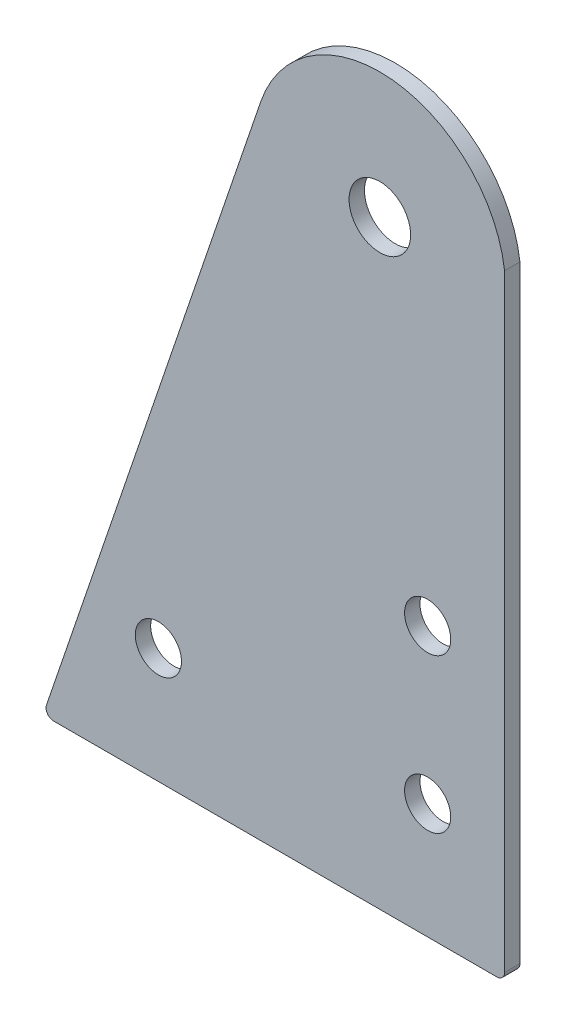
ISO-10303-21;
HEADER;
FILE_DESCRIPTION(('STEP AP214'),'2;1');
FILE_NAME('part.step','',(''),(''),'','','');
FILE_SCHEMA(('AUTOMOTIVE_DESIGN { 1 0 10303 214 1 1 1 1 }'));
ENDSEC;
DATA;
#1=APPLICATION_CONTEXT('core data for automotive mechanical design processes');
#2=APPLICATION_PROTOCOL_DEFINITION('international standard','automotive_design',2000,#1);
#3=PRODUCT_CONTEXT('',#1,'mechanical');
#4=PRODUCT('Part','Part','',(#3));
#5=PRODUCT_RELATED_PRODUCT_CATEGORY('part','',(#4));
#6=PRODUCT_DEFINITION_FORMATION('','',#4);
#7=PRODUCT_DEFINITION_CONTEXT('part definition',#1,'design');
#8=PRODUCT_DEFINITION('design','',#6,#7);
#9=PRODUCT_DEFINITION_SHAPE('','',#8);
#10=(LENGTH_UNIT() NAMED_UNIT(*) SI_UNIT(.MILLI.,.METRE.));
#11=(NAMED_UNIT(*) PLANE_ANGLE_UNIT() SI_UNIT($,.RADIAN.));
#12=(NAMED_UNIT(*) SI_UNIT($,.STERADIAN.) SOLID_ANGLE_UNIT());
#13=UNCERTAINTY_MEASURE_WITH_UNIT(LENGTH_MEASURE(1.E-05),#10,'distance_accuracy_value','');
#14=(GEOMETRIC_REPRESENTATION_CONTEXT(3) GLOBAL_UNCERTAINTY_ASSIGNED_CONTEXT((#13)) GLOBAL_UNIT_ASSIGNED_CONTEXT((#10,
#11,#12)) REPRESENTATION_CONTEXT('',''));
#15=CARTESIAN_POINT('',(0.,0.,0.));
#16=DIRECTION('',(0.,0.,1.));
#17=DIRECTION('',(1.,0.,0.));
#18=AXIS2_PLACEMENT_3D('',#15,#16,#17);
#19=CARTESIAN_POINT('',(0.,0.,-2.));
#20=DIRECTION('',(-1.,0.,0.));
#21=DIRECTION('',(0.,0.,-1.));
#22=AXIS2_PLACEMENT_3D('',#19,#20,#21);
#23=PLANE('',#22);
#24=DIRECTION('',(0.,1.,0.));
#25=VECTOR('',#24,1.);
#26=CARTESIAN_POINT('',(0.,0.,-2.));
#27=LINE('',#26,#25);
#28=CARTESIAN_POINT('',(0.,1.,-2.));
#29=VERTEX_POINT('',#28);
#30=CARTESIAN_POINT('',(0.,79.9999999999999,-2.));
#31=VERTEX_POINT('',#30);
#32=EDGE_CURVE('E85',#29,#31,#27,.T.);
#33=ORIENTED_EDGE('',*,*,#32,.T.);
#34=DIRECTION('',(0.,0.,1.));
#35=VECTOR('',#34,1.);
#36=CARTESIAN_POINT('',(0.,79.9999999999999,-2.));
#37=LINE('',#36,#35);
#38=CARTESIAN_POINT('',(0.,79.9999999999999,0.));
#39=VERTEX_POINT('',#38);
#40=EDGE_CURVE('E93',#31,#39,#37,.T.);
#41=ORIENTED_EDGE('',*,*,#40,.T.);
#42=DIRECTION('',(0.,1.,0.));
#43=VECTOR('',#42,1.);
#44=CARTESIAN_POINT('',(0.,0.,0.));
#45=LINE('',#44,#43);
#46=CARTESIAN_POINT('',(0.,1.,0.));
#47=VERTEX_POINT('',#46);
#48=EDGE_CURVE('E118',#47,#39,#45,.T.);
#49=ORIENTED_EDGE('',*,*,#48,.F.);
#50=DIRECTION('',(0.,0.,1.));
#51=VECTOR('',#50,1.);
#52=CARTESIAN_POINT('',(0.,1.,-2.));
#53=LINE('',#52,#51);
#54=EDGE_CURVE('E100',#29,#47,#53,.T.);
#55=ORIENTED_EDGE('',*,*,#54,.F.);
#56=EDGE_LOOP('',(#33,#41,#49,#55));
#57=FACE_BOUND('',#56,.T.);
#58=ADVANCED_FACE('F33',(#57),#23,.F.);
#59=CARTESIAN_POINT('',(-16.2149706208328,77.9312961356805,-2.));
#60=DIRECTION('',(0.,0.,1.));
#61=DIRECTION('',(-1.,0.,0.));
#62=AXIS2_PLACEMENT_3D('',#59,#60,#61);
#63=CYLINDRICAL_SURFACE('',#62,16.3464004573705);
#64=CARTESIAN_POINT('',(-16.2149706208328,77.9312961356805,0.));
#65=DIRECTION('',(0.,0.,1.));
#66=DIRECTION('',(1.,0.,0.));
#67=AXIS2_PLACEMENT_3D('',#64,#65,#66);
#68=CIRCLE('',#67,16.3464004573705);
#69=CARTESIAN_POINT('',(-31.6899927739786,83.1970816679981,0.));
#70=VERTEX_POINT('',#69);
#71=EDGE_CURVE('E96',#39,#70,#68,.T.);
#72=ORIENTED_EDGE('',*,*,#71,.F.);
#73=ORIENTED_EDGE('',*,*,#40,.F.);
#74=CARTESIAN_POINT('',(-16.2149706208328,77.9312961356805,-2.));
#75=DIRECTION('',(0.,0.,1.));
#76=DIRECTION('',(1.,0.,0.));
#77=AXIS2_PLACEMENT_3D('',#74,#75,#76);
#78=CIRCLE('',#77,16.3464004573705);
#79=CARTESIAN_POINT('',(-31.6899927739786,83.1970816679981,-2.));
#80=VERTEX_POINT('',#79);
#81=EDGE_CURVE('E81',#31,#80,#78,.T.);
#82=ORIENTED_EDGE('',*,*,#81,.T.);
#83=DIRECTION('',(0.,0.,1.));
#84=VECTOR('',#83,1.);
#85=CARTESIAN_POINT('',(-31.6899927739786,83.1970816679981,-2.));
#86=LINE('',#85,#84);
#87=EDGE_CURVE('E101',#80,#70,#86,.T.);
#88=ORIENTED_EDGE('',*,*,#87,.T.);
#89=EDGE_LOOP('',(#72,#73,#82,#88));
#90=FACE_BOUND('',#89,.T.);
#91=ADVANCED_FACE('F94',(#90),#63,.T.);
#92=CARTESIAN_POINT('',(-53.7736530665817,18.2979075270865,-2.));
#93=DIRECTION('',(-0.946692955033307,0.322137313719327,0.));
#94=DIRECTION('',(-0.322137313719327,-0.946692955033307,0.));
#95=AXIS2_PLACEMENT_3D('',#92,#93,#94);
#96=PLANE('',#95);
#97=DIRECTION('',(0.322137313719327,0.946692955033307,0.));
#98=VECTOR('',#97,1.);
#99=CARTESIAN_POINT('',(-53.7736530665817,18.2979075270865,0.));
#100=LINE('',#99,#98);
#101=CARTESIAN_POINT('',(-59.5501078144237,1.32213731371933,0.));
#102=VERTEX_POINT('',#101);
#103=EDGE_CURVE('E108',#102,#70,#100,.T.);
#104=ORIENTED_EDGE('',*,*,#103,.T.);
#105=ORIENTED_EDGE('',*,*,#87,.F.);
#106=DIRECTION('',(0.322137313719327,0.946692955033307,0.));
#107=VECTOR('',#106,1.);
#108=CARTESIAN_POINT('',(-53.7736530665817,18.2979075270865,-2.));
#109=LINE('',#108,#107);
#110=CARTESIAN_POINT('',(-59.5501078144237,1.32213731371933,-2.));
#111=VERTEX_POINT('',#110);
#112=EDGE_CURVE('E87',#111,#80,#109,.T.);
#113=ORIENTED_EDGE('',*,*,#112,.F.);
#114=DIRECTION('',(0.,0.,1.));
#115=VECTOR('',#114,1.);
#116=CARTESIAN_POINT('',(-59.5501078144237,1.32213731371933,-2.));
#117=LINE('',#116,#115);
#118=EDGE_CURVE('E11',#102,#111,#117,.F.);
#119=ORIENTED_EDGE('',*,*,#118,.F.);
#120=EDGE_LOOP('',(#104,#105,#113,#119));
#121=FACE_BOUND('',#120,.T.);
#122=ADVANCED_FACE('F145',(#121),#96,.T.);
#123=CARTESIAN_POINT('',(0.,0.,-2.));
#124=DIRECTION('',(0.,1.,0.));
#125=DIRECTION('',(0.,0.,-1.));
#126=AXIS2_PLACEMENT_3D('',#123,#124,#125);
#127=PLANE('',#126);
#128=DIRECTION('',(1.,0.,0.));
#129=VECTOR('',#128,1.);
#130=CARTESIAN_POINT('',(0.,0.,0.));
#131=LINE('',#130,#129);
#132=CARTESIAN_POINT('',(-58.6034148593904,0.,0.));
#133=VERTEX_POINT('',#132);
#134=CARTESIAN_POINT('',(-0.999999999999987,0.,0.));
#135=VERTEX_POINT('',#134);
#136=EDGE_CURVE('E105',#133,#135,#131,.T.);
#137=ORIENTED_EDGE('',*,*,#136,.F.);
#138=DIRECTION('',(0.,0.,1.));
#139=VECTOR('',#138,1.);
#140=CARTESIAN_POINT('',(-58.6034148593904,0.,0.));
#141=LINE('',#140,#139);
#142=CARTESIAN_POINT('',(-58.6034148593904,0.,-2.));
#143=VERTEX_POINT('',#142);
#144=EDGE_CURVE('E129',#143,#133,#141,.T.);
#145=ORIENTED_EDGE('',*,*,#144,.F.);
#146=DIRECTION('',(1.,0.,0.));
#147=VECTOR('',#146,1.);
#148=CARTESIAN_POINT('',(0.,0.,-2.));
#149=LINE('',#148,#147);
#150=CARTESIAN_POINT('',(-0.999999999999987,0.,-2.));
#151=VERTEX_POINT('',#150);
#152=EDGE_CURVE('E115',#143,#151,#149,.T.);
#153=ORIENTED_EDGE('',*,*,#152,.T.);
#154=DIRECTION('',(0.,0.,1.));
#155=VECTOR('',#154,1.);
#156=CARTESIAN_POINT('',(-0.999999999999987,0.,-2.));
#157=LINE('',#156,#155);
#158=EDGE_CURVE('E132',#135,#151,#157,.F.);
#159=ORIENTED_EDGE('',*,*,#158,.F.);
#160=EDGE_LOOP('',(#137,#145,#153,#159));
#161=FACE_BOUND('',#160,.T.);
#162=ADVANCED_FACE('F140',(#161),#127,.F.);
#163=CARTESIAN_POINT('',(0.,0.,-2.));
#164=DIRECTION('',(0.,0.,-1.));
#165=DIRECTION('',(1.,0.,0.));
#166=AXIS2_PLACEMENT_3D('',#163,#164,#165);
#167=PLANE('',#166);
#168=CARTESIAN_POINT('',(-9.99999999999999,35.,-2.));
#169=DIRECTION('',(0.,0.,1.));
#170=DIRECTION('',(1.,0.,0.));
#171=AXIS2_PLACEMENT_3D('',#168,#169,#170);
#172=CIRCLE('',#171,3.);
#173=CARTESIAN_POINT('',(-6.99999999999999,35.,-2.));
#174=VERTEX_POINT('',#173);
#175=EDGE_CURVE('E227',#174,#174,#172,.T.);
#176=ORIENTED_EDGE('',*,*,#175,.T.);
#177=EDGE_LOOP('',(#176));
#178=FACE_BOUND('',#177,.T.);
#179=CARTESIAN_POINT('',(-9.99999999999998,15.,-2.));
#180=DIRECTION('',(0.,0.,1.));
#181=DIRECTION('',(1.,0.,0.));
#182=AXIS2_PLACEMENT_3D('',#179,#180,#181);
#183=CIRCLE('',#182,3.);
#184=CARTESIAN_POINT('',(-6.99999999999998,15.,-2.));
#185=VERTEX_POINT('',#184);
#186=EDGE_CURVE('E232',#185,#185,#183,.T.);
#187=ORIENTED_EDGE('',*,*,#186,.T.);
#188=EDGE_LOOP('',(#187));
#189=FACE_BOUND('',#188,.T.);
#190=CARTESIAN_POINT('',(-45.,15.,-2.));
#191=DIRECTION('',(0.,0.,1.));
#192=DIRECTION('',(1.,0.,0.));
#193=AXIS2_PLACEMENT_3D('',#190,#191,#192);
#194=CIRCLE('',#193,3.);
#195=CARTESIAN_POINT('',(-42.,15.,-2.));
#196=VERTEX_POINT('',#195);
#197=EDGE_CURVE('E240',#196,#196,#194,.T.);
#198=ORIENTED_EDGE('',*,*,#197,.T.);
#199=EDGE_LOOP('',(#198));
#200=FACE_BOUND('',#199,.T.);
#201=CARTESIAN_POINT('',(-16.2149706208328,77.9312961356805,-2.));
#202=DIRECTION('',(0.,0.,1.));
#203=DIRECTION('',(1.,0.,0.));
#204=AXIS2_PLACEMENT_3D('',#201,#202,#203);
#205=CIRCLE('',#204,4.);
#206=CARTESIAN_POINT('',(-12.2149706208328,77.9312961356805,-2.));
#207=VERTEX_POINT('',#206);
#208=EDGE_CURVE('E111',#207,#207,#205,.T.);
#209=ORIENTED_EDGE('',*,*,#208,.T.);
#210=EDGE_LOOP('',(#209));
#211=FACE_BOUND('',#210,.T.);
#212=ORIENTED_EDGE('',*,*,#152,.F.);
#213=CARTESIAN_POINT('',(-58.6034148593904,1.,-2.));
#214=DIRECTION('',(0.,0.,1.));
#215=DIRECTION('',(1.,0.,0.));
#216=AXIS2_PLACEMENT_3D('',#213,#214,#215);
#217=CIRCLE('',#216,1.);
#218=EDGE_CURVE('E48',#111,#143,#217,.T.);
#219=ORIENTED_EDGE('',*,*,#218,.F.);
#220=ORIENTED_EDGE('',*,*,#112,.T.);
#221=ORIENTED_EDGE('',*,*,#81,.F.);
#222=ORIENTED_EDGE('',*,*,#32,.F.);
#223=CARTESIAN_POINT('',(-0.999999999999987,1.,-2.));
#224=DIRECTION('',(0.,0.,1.));
#225=DIRECTION('',(1.,0.,0.));
#226=AXIS2_PLACEMENT_3D('',#223,#224,#225);
#227=CIRCLE('',#226,1.);
#228=EDGE_CURVE('E41',#151,#29,#227,.T.);
#229=ORIENTED_EDGE('',*,*,#228,.F.);
#230=EDGE_LOOP('',(#212,#219,#220,#221,#222,#229));
#231=FACE_BOUND('',#230,.T.);
#232=ADVANCED_FACE('F83',(#178,#189,#200,#211,#231),#167,.T.);
#233=CARTESIAN_POINT('',(0.,0.,0.));
#234=DIRECTION('',(0.,0.,-1.));
#235=DIRECTION('',(1.,0.,0.));
#236=AXIS2_PLACEMENT_3D('',#233,#234,#235);
#237=PLANE('',#236);
#238=CARTESIAN_POINT('',(-9.99999999999999,35.,0.));
#239=DIRECTION('',(0.,0.,1.));
#240=DIRECTION('',(1.,0.,0.));
#241=AXIS2_PLACEMENT_3D('',#238,#239,#240);
#242=CIRCLE('',#241,3.);
#243=CARTESIAN_POINT('',(-6.99999999999999,35.,0.));
#244=VERTEX_POINT('',#243);
#245=EDGE_CURVE('E224',#244,#244,#242,.T.);
#246=ORIENTED_EDGE('',*,*,#245,.F.);
#247=EDGE_LOOP('',(#246));
#248=FACE_BOUND('',#247,.T.);
#249=CARTESIAN_POINT('',(-9.99999999999998,15.,0.));
#250=DIRECTION('',(0.,0.,1.));
#251=DIRECTION('',(1.,0.,0.));
#252=AXIS2_PLACEMENT_3D('',#249,#250,#251);
#253=CIRCLE('',#252,3.);
#254=CARTESIAN_POINT('',(-6.99999999999998,15.,0.));
#255=VERTEX_POINT('',#254);
#256=EDGE_CURVE('E228',#255,#255,#253,.T.);
#257=ORIENTED_EDGE('',*,*,#256,.F.);
#258=EDGE_LOOP('',(#257));
#259=FACE_BOUND('',#258,.T.);
#260=CARTESIAN_POINT('',(-45.,15.,0.));
#261=DIRECTION('',(0.,0.,1.));
#262=DIRECTION('',(1.,0.,0.));
#263=AXIS2_PLACEMENT_3D('',#260,#261,#262);
#264=CIRCLE('',#263,3.);
#265=CARTESIAN_POINT('',(-42.,15.,0.));
#266=VERTEX_POINT('',#265);
#267=EDGE_CURVE('E237',#266,#266,#264,.T.);
#268=ORIENTED_EDGE('',*,*,#267,.F.);
#269=EDGE_LOOP('',(#268));
#270=FACE_BOUND('',#269,.T.);
#271=CARTESIAN_POINT('',(-16.2149706208328,77.9312961356805,0.));
#272=DIRECTION('',(0.,0.,1.));
#273=DIRECTION('',(1.,0.,0.));
#274=AXIS2_PLACEMENT_3D('',#271,#272,#273);
#275=CIRCLE('',#274,4.);
#276=CARTESIAN_POINT('',(-12.2149706208328,77.9312961356805,0.));
#277=VERTEX_POINT('',#276);
#278=EDGE_CURVE('E120',#277,#277,#275,.T.);
#279=ORIENTED_EDGE('',*,*,#278,.F.);
#280=EDGE_LOOP('',(#279));
#281=FACE_BOUND('',#280,.T.);
#282=ORIENTED_EDGE('',*,*,#48,.T.);
#283=ORIENTED_EDGE('',*,*,#71,.T.);
#284=ORIENTED_EDGE('',*,*,#103,.F.);
#285=CARTESIAN_POINT('',(-58.6034148593904,1.,0.));
#286=DIRECTION('',(0.,0.,1.));
#287=DIRECTION('',(1.,0.,0.));
#288=AXIS2_PLACEMENT_3D('',#285,#286,#287);
#289=CIRCLE('',#288,1.);
#290=EDGE_CURVE('E125',#133,#102,#289,.F.);
#291=ORIENTED_EDGE('',*,*,#290,.F.);
#292=ORIENTED_EDGE('',*,*,#136,.T.);
#293=CARTESIAN_POINT('',(-0.999999999999987,1.,0.));
#294=DIRECTION('',(0.,0.,1.));
#295=DIRECTION('',(1.,0.,0.));
#296=AXIS2_PLACEMENT_3D('',#293,#294,#295);
#297=CIRCLE('',#296,1.);
#298=EDGE_CURVE('E127',#47,#135,#297,.F.);
#299=ORIENTED_EDGE('',*,*,#298,.F.);
#300=EDGE_LOOP('',(#282,#283,#284,#291,#292,#299));
#301=FACE_BOUND('',#300,.T.);
#302=ADVANCED_FACE('F147',(#248,#259,#270,#281,#301),#237,.F.);
#303=CARTESIAN_POINT('',(-0.999999999999987,1.,-2.));
#304=DIRECTION('',(0.,0.,1.));
#305=DIRECTION('',(-1.,0.,0.));
#306=AXIS2_PLACEMENT_3D('',#303,#304,#305);
#307=CYLINDRICAL_SURFACE('',#306,1.);
#308=ORIENTED_EDGE('',*,*,#228,.T.);
#309=ORIENTED_EDGE('',*,*,#54,.T.);
#310=ORIENTED_EDGE('',*,*,#298,.T.);
#311=ORIENTED_EDGE('',*,*,#158,.T.);
#312=EDGE_LOOP('',(#308,#309,#310,#311));
#313=FACE_BOUND('',#312,.T.);
#314=ADVANCED_FACE('F135',(#313),#307,.T.);
#315=CARTESIAN_POINT('',(-58.6034148593904,1.,-2.));
#316=DIRECTION('',(0.,0.,-1.));
#317=DIRECTION('',(1.,0.,0.));
#318=AXIS2_PLACEMENT_3D('',#315,#316,#317);
#319=CYLINDRICAL_SURFACE('',#318,1.);
#320=ORIENTED_EDGE('',*,*,#218,.T.);
#321=ORIENTED_EDGE('',*,*,#144,.T.);
#322=ORIENTED_EDGE('',*,*,#290,.T.);
#323=ORIENTED_EDGE('',*,*,#118,.T.);
#324=EDGE_LOOP('',(#320,#321,#322,#323));
#325=FACE_BOUND('',#324,.T.);
#326=ADVANCED_FACE('F35',(#325),#319,.T.);
#327=CARTESIAN_POINT('',(-16.2149706208328,77.9312961356805,0.));
#328=DIRECTION('',(0.,0.,-1.));
#329=DIRECTION('',(1.,0.,0.));
#330=AXIS2_PLACEMENT_3D('',#327,#328,#329);
#331=CYLINDRICAL_SURFACE('',#330,4.);
#332=CARTESIAN_POINT('',(-12.2149706208328,77.9312961356805,0.));
#333=CARTESIAN_POINT('',(-12.2149706208328,77.9312961356805,-0.0208333333333333));
#334=CARTESIAN_POINT('',(-12.2149706208328,77.9312961356805,-0.0416666666666667));
#335=CARTESIAN_POINT('',(-12.2149706208328,77.9312961356805,-0.0833333333333334));
#336=CARTESIAN_POINT('',(-12.2149706208328,77.9312961356805,-0.104166666666667));
#337=CARTESIAN_POINT('',(-12.2149706208328,77.9312961356805,-0.145833333333333));
#338=CARTESIAN_POINT('',(-12.2149706208328,77.9312961356805,-0.166666666666667));
#339=CARTESIAN_POINT('',(-12.2149706208328,77.9312961356805,-0.208333333333334));
#340=CARTESIAN_POINT('',(-12.2149706208328,77.9312961356805,-0.229166666666667));
#341=CARTESIAN_POINT('',(-12.2149706208328,77.9312961356805,-0.270833333333334));
#342=CARTESIAN_POINT('',(-12.2149706208328,77.9312961356805,-0.291666666666667));
#343=CARTESIAN_POINT('',(-12.2149706208328,77.9312961356805,-0.333333333333334));
#344=CARTESIAN_POINT('',(-12.2149706208328,77.9312961356805,-0.354166666666667));
#345=CARTESIAN_POINT('',(-12.2149706208328,77.9312961356805,-0.395833333333334));
#346=CARTESIAN_POINT('',(-12.2149706208328,77.9312961356805,-0.416666666666667));
#347=CARTESIAN_POINT('',(-12.2149706208328,77.9312961356805,-0.458333333333334));
#348=CARTESIAN_POINT('',(-12.2149706208328,77.9312961356805,-0.479166666666667));
#349=CARTESIAN_POINT('',(-12.2149706208328,77.9312961356805,-0.520833333333334));
#350=CARTESIAN_POINT('',(-12.2149706208328,77.9312961356805,-0.541666666666667));
#351=CARTESIAN_POINT('',(-12.2149706208328,77.9312961356805,-0.583333333333334));
#352=CARTESIAN_POINT('',(-12.2149706208328,77.9312961356805,-0.604166666666667));
#353=CARTESIAN_POINT('',(-12.2149706208328,77.9312961356805,-0.645833333333334));
#354=CARTESIAN_POINT('',(-12.2149706208328,77.9312961356805,-0.666666666666667));
#355=CARTESIAN_POINT('',(-12.2149706208328,77.9312961356805,-0.708333333333334));
#356=CARTESIAN_POINT('',(-12.2149706208328,77.9312961356805,-0.729166666666667));
#357=CARTESIAN_POINT('',(-12.2149706208328,77.9312961356805,-0.770833333333334));
#358=CARTESIAN_POINT('',(-12.2149706208328,77.9312961356805,-0.791666666666667));
#359=CARTESIAN_POINT('',(-12.2149706208328,77.9312961356805,-0.833333333333334));
#360=CARTESIAN_POINT('',(-12.2149706208328,77.9312961356805,-0.854166666666667));
#361=CARTESIAN_POINT('',(-12.2149706208328,77.9312961356805,-0.895833333333334));
#362=CARTESIAN_POINT('',(-12.2149706208328,77.9312961356805,-0.916666666666668));
#363=CARTESIAN_POINT('',(-12.2149706208328,77.9312961356805,-0.958333333333334));
#364=CARTESIAN_POINT('',(-12.2149706208328,77.9312961356805,-0.979166666666668));
#365=CARTESIAN_POINT('',(-12.2149706208328,77.9312961356805,-1.02083333333333));
#366=CARTESIAN_POINT('',(-12.2149706208328,77.9312961356805,-1.04166666666667));
#367=CARTESIAN_POINT('',(-12.2149706208328,77.9312961356805,-1.08333333333333));
#368=CARTESIAN_POINT('',(-12.2149706208328,77.9312961356805,-1.10416666666667));
#369=CARTESIAN_POINT('',(-12.2149706208328,77.9312961356805,-1.14583333333333));
#370=CARTESIAN_POINT('',(-12.2149706208328,77.9312961356805,-1.16666666666667));
#371=CARTESIAN_POINT('',(-12.2149706208328,77.9312961356805,-1.20833333333333));
#372=CARTESIAN_POINT('',(-12.2149706208328,77.9312961356805,-1.22916666666667));
#373=CARTESIAN_POINT('',(-12.2149706208328,77.9312961356805,-1.27083333333333));
#374=CARTESIAN_POINT('',(-12.2149706208328,77.9312961356805,-1.29166666666667));
#375=CARTESIAN_POINT('',(-12.2149706208328,77.9312961356805,-1.33333333333333));
#376=CARTESIAN_POINT('',(-12.2149706208328,77.9312961356805,-1.35416666666667));
#377=CARTESIAN_POINT('',(-12.2149706208328,77.9312961356805,-1.39583333333333));
#378=CARTESIAN_POINT('',(-12.2149706208328,77.9312961356805,-1.41666666666667));
#379=CARTESIAN_POINT('',(-12.2149706208328,77.9312961356805,-1.45833333333333));
#380=CARTESIAN_POINT('',(-12.2149706208328,77.9312961356805,-1.47916666666667));
#381=CARTESIAN_POINT('',(-12.2149706208328,77.9312961356805,-1.52083333333333));
#382=CARTESIAN_POINT('',(-12.2149706208328,77.9312961356805,-1.54166666666667));
#383=CARTESIAN_POINT('',(-12.2149706208328,77.9312961356805,-1.58333333333333));
#384=CARTESIAN_POINT('',(-12.2149706208328,77.9312961356805,-1.60416666666667));
#385=CARTESIAN_POINT('',(-12.2149706208328,77.9312961356805,-1.64583333333333));
#386=CARTESIAN_POINT('',(-12.2149706208328,77.9312961356805,-1.66666666666667));
#387=CARTESIAN_POINT('',(-12.2149706208328,77.9312961356805,-1.70833333333333));
#388=CARTESIAN_POINT('',(-12.2149706208328,77.9312961356805,-1.72916666666667));
#389=CARTESIAN_POINT('',(-12.2149706208328,77.9312961356805,-1.77083333333334));
#390=CARTESIAN_POINT('',(-12.2149706208328,77.9312961356805,-1.79166666666667));
#391=CARTESIAN_POINT('',(-12.2149706208328,77.9312961356805,-1.83333333333334));
#392=CARTESIAN_POINT('',(-12.2149706208328,77.9312961356805,-1.85416666666667));
#393=CARTESIAN_POINT('',(-12.2149706208328,77.9312961356805,-1.89583333333334));
#394=CARTESIAN_POINT('',(-12.2149706208328,77.9312961356805,-1.91666666666667));
#395=CARTESIAN_POINT('',(-12.2149706208328,77.9312961356805,-1.95833333333334));
#396=CARTESIAN_POINT('',(-12.2149706208328,77.9312961356805,-1.97916666666667));
#397=CARTESIAN_POINT('',(-12.2149706208328,77.9312961356805,-2.));
#398=B_SPLINE_CURVE_WITH_KNOTS('',3,(#332,#333,#334,#335,#336,#337,#338,#339,#340,#341,#342,
#343,#344,#345,#346,#347,#348,#349,#350,#351,#352,#353,#354,#355,#356,#357,#358,#359,#360,#361,
#362,#363,#364,#365,#366,#367,#368,#369,#370,#371,#372,#373,#374,#375,#376,#377,#378,#379,#380,
#381,#382,#383,#384,#385,#386,#387,#388,#389,#390,#391,#392,#393,#394,#395,#396,#397),
.UNSPECIFIED.,.F.,.F.,(4,2,2,2,2,2,2,2,2,2,2,2,2,2,2,2,2,2,2,2,2,2,2,2,2,2,2,2,2,2,2,2,4),(0.,
0.0625000000000001,0.125,0.1875,0.25,0.3125,0.375,0.4375,0.5,0.5625,0.625,0.687500000000001,
0.750000000000001,0.812500000000001,0.875000000000001,0.937500000000001,1.,1.0625,1.125,1.1875,
1.25,1.3125,1.375,1.4375,1.5,1.5625,1.625,1.6875,1.75,1.8125,1.875,1.9375,2.),.UNSPECIFIED.);
#399=EDGE_CURVE('BSEAM190',#277,#207,#398,.T.);
#400=ORIENTED_EDGE('',*,*,#278,.T.);
#401=ORIENTED_EDGE('',*,*,#208,.F.);
#402=ORIENTED_EDGE('',*,*,#399,.T.);
#403=ORIENTED_EDGE('',*,*,#399,.F.);
#404=EDGE_LOOP('',(#400,#402,#401,#403));
#405=FACE_BOUND('',#404,.T.);
#406=ADVANCED_FACE('F190',(#405),#331,.F.);
#407=CARTESIAN_POINT('',(-45.,15.,0.));
#408=DIRECTION('',(0.,0.,-1.));
#409=DIRECTION('',(1.,0.,0.));
#410=AXIS2_PLACEMENT_3D('',#407,#408,#409);
#411=CYLINDRICAL_SURFACE('',#410,3.);
#412=CARTESIAN_POINT('',(-42.,15.,0.));
#413=CARTESIAN_POINT('',(-42.,15.,-0.0208333333333333));
#414=CARTESIAN_POINT('',(-42.,15.,-0.0416666666666667));
#415=CARTESIAN_POINT('',(-42.,15.,-0.0833333333333334));
#416=CARTESIAN_POINT('',(-42.,15.,-0.104166666666667));
#417=CARTESIAN_POINT('',(-42.,15.,-0.145833333333333));
#418=CARTESIAN_POINT('',(-42.,15.,-0.166666666666667));
#419=CARTESIAN_POINT('',(-42.,15.,-0.208333333333334));
#420=CARTESIAN_POINT('',(-42.,15.,-0.229166666666667));
#421=CARTESIAN_POINT('',(-42.,15.,-0.270833333333334));
#422=CARTESIAN_POINT('',(-42.,15.,-0.291666666666667));
#423=CARTESIAN_POINT('',(-42.,15.,-0.333333333333334));
#424=CARTESIAN_POINT('',(-42.,15.,-0.354166666666667));
#425=CARTESIAN_POINT('',(-42.,15.,-0.395833333333334));
#426=CARTESIAN_POINT('',(-42.,15.,-0.416666666666667));
#427=CARTESIAN_POINT('',(-42.,15.,-0.458333333333334));
#428=CARTESIAN_POINT('',(-42.,15.,-0.479166666666667));
#429=CARTESIAN_POINT('',(-42.,15.,-0.520833333333334));
#430=CARTESIAN_POINT('',(-42.,15.,-0.541666666666667));
#431=CARTESIAN_POINT('',(-42.,15.,-0.583333333333334));
#432=CARTESIAN_POINT('',(-42.,15.,-0.604166666666667));
#433=CARTESIAN_POINT('',(-42.,15.,-0.645833333333334));
#434=CARTESIAN_POINT('',(-42.,15.,-0.666666666666667));
#435=CARTESIAN_POINT('',(-42.,15.,-0.708333333333334));
#436=CARTESIAN_POINT('',(-42.,15.,-0.729166666666667));
#437=CARTESIAN_POINT('',(-42.,15.,-0.770833333333334));
#438=CARTESIAN_POINT('',(-42.,15.,-0.791666666666667));
#439=CARTESIAN_POINT('',(-42.,15.,-0.833333333333334));
#440=CARTESIAN_POINT('',(-42.,15.,-0.854166666666667));
#441=CARTESIAN_POINT('',(-42.,15.,-0.895833333333334));
#442=CARTESIAN_POINT('',(-42.,15.,-0.916666666666668));
#443=CARTESIAN_POINT('',(-42.,15.,-0.958333333333334));
#444=CARTESIAN_POINT('',(-42.,15.,-0.979166666666668));
#445=CARTESIAN_POINT('',(-42.,15.,-1.02083333333333));
#446=CARTESIAN_POINT('',(-42.,15.,-1.04166666666667));
#447=CARTESIAN_POINT('',(-42.,15.,-1.08333333333333));
#448=CARTESIAN_POINT('',(-42.,15.,-1.10416666666667));
#449=CARTESIAN_POINT('',(-42.,15.,-1.14583333333333));
#450=CARTESIAN_POINT('',(-42.,15.,-1.16666666666667));
#451=CARTESIAN_POINT('',(-42.,15.,-1.20833333333333));
#452=CARTESIAN_POINT('',(-42.,15.,-1.22916666666667));
#453=CARTESIAN_POINT('',(-42.,15.,-1.27083333333333));
#454=CARTESIAN_POINT('',(-42.,15.,-1.29166666666667));
#455=CARTESIAN_POINT('',(-42.,15.,-1.33333333333333));
#456=CARTESIAN_POINT('',(-42.,15.,-1.35416666666667));
#457=CARTESIAN_POINT('',(-42.,15.,-1.39583333333333));
#458=CARTESIAN_POINT('',(-42.,15.,-1.41666666666667));
#459=CARTESIAN_POINT('',(-42.,15.,-1.45833333333333));
#460=CARTESIAN_POINT('',(-42.,15.,-1.47916666666667));
#461=CARTESIAN_POINT('',(-42.,15.,-1.52083333333333));
#462=CARTESIAN_POINT('',(-42.,15.,-1.54166666666667));
#463=CARTESIAN_POINT('',(-42.,15.,-1.58333333333333));
#464=CARTESIAN_POINT('',(-42.,15.,-1.60416666666667));
#465=CARTESIAN_POINT('',(-42.,15.,-1.64583333333333));
#466=CARTESIAN_POINT('',(-42.,15.,-1.66666666666667));
#467=CARTESIAN_POINT('',(-42.,15.,-1.70833333333333));
#468=CARTESIAN_POINT('',(-42.,15.,-1.72916666666667));
#469=CARTESIAN_POINT('',(-42.,15.,-1.77083333333334));
#470=CARTESIAN_POINT('',(-42.,15.,-1.79166666666667));
#471=CARTESIAN_POINT('',(-42.,15.,-1.83333333333334));
#472=CARTESIAN_POINT('',(-42.,15.,-1.85416666666667));
#473=CARTESIAN_POINT('',(-42.,15.,-1.89583333333334));
#474=CARTESIAN_POINT('',(-42.,15.,-1.91666666666667));
#475=CARTESIAN_POINT('',(-42.,15.,-1.95833333333334));
#476=CARTESIAN_POINT('',(-42.,15.,-1.97916666666667));
#477=CARTESIAN_POINT('',(-42.,15.,-2.));
#478=B_SPLINE_CURVE_WITH_KNOTS('',3,(#412,#413,#414,#415,#416,#417,#418,#419,#420,#421,#422,
#423,#424,#425,#426,#427,#428,#429,#430,#431,#432,#433,#434,#435,#436,#437,#438,#439,#440,#441,
#442,#443,#444,#445,#446,#447,#448,#449,#450,#451,#452,#453,#454,#455,#456,#457,#458,#459,#460,
#461,#462,#463,#464,#465,#466,#467,#468,#469,#470,#471,#472,#473,#474,#475,#476,#477),
.UNSPECIFIED.,.F.,.F.,(4,2,2,2,2,2,2,2,2,2,2,2,2,2,2,2,2,2,2,2,2,2,2,2,2,2,2,2,2,2,2,2,4),(0.,
0.0625000000000001,0.125,0.1875,0.25,0.3125,0.375,0.4375,0.5,0.5625,0.625,0.687500000000001,
0.750000000000001,0.812500000000001,0.875000000000001,0.937500000000001,1.,1.0625,1.125,1.1875,
1.25,1.3125,1.375,1.4375,1.5,1.5625,1.625,1.6875,1.75,1.8125,1.875,1.9375,2.),.UNSPECIFIED.);
#479=EDGE_CURVE('BSEAM196',#266,#196,#478,.T.);
#480=ORIENTED_EDGE('',*,*,#267,.T.);
#481=ORIENTED_EDGE('',*,*,#197,.F.);
#482=ORIENTED_EDGE('',*,*,#479,.T.);
#483=ORIENTED_EDGE('',*,*,#479,.F.);
#484=EDGE_LOOP('',(#480,#482,#481,#483));
#485=FACE_BOUND('',#484,.T.);
#486=ADVANCED_FACE('F196',(#485),#411,.F.);
#487=CARTESIAN_POINT('',(-9.99999999999998,15.,0.));
#488=DIRECTION('',(0.,0.,-1.));
#489=DIRECTION('',(1.,0.,0.));
#490=AXIS2_PLACEMENT_3D('',#487,#488,#489);
#491=CYLINDRICAL_SURFACE('',#490,3.);
#492=CARTESIAN_POINT('',(-6.99999999999998,15.,0.));
#493=CARTESIAN_POINT('',(-6.99999999999998,15.,-0.0208333333333333));
#494=CARTESIAN_POINT('',(-6.99999999999998,15.,-0.0416666666666667));
#495=CARTESIAN_POINT('',(-6.99999999999998,15.,-0.0833333333333334));
#496=CARTESIAN_POINT('',(-6.99999999999998,15.,-0.104166666666667));
#497=CARTESIAN_POINT('',(-6.99999999999998,15.,-0.145833333333333));
#498=CARTESIAN_POINT('',(-6.99999999999998,15.,-0.166666666666667));
#499=CARTESIAN_POINT('',(-6.99999999999998,15.,-0.208333333333334));
#500=CARTESIAN_POINT('',(-6.99999999999998,15.,-0.229166666666667));
#501=CARTESIAN_POINT('',(-6.99999999999998,15.,-0.270833333333334));
#502=CARTESIAN_POINT('',(-6.99999999999998,15.,-0.291666666666667));
#503=CARTESIAN_POINT('',(-6.99999999999998,15.,-0.333333333333334));
#504=CARTESIAN_POINT('',(-6.99999999999998,15.,-0.354166666666667));
#505=CARTESIAN_POINT('',(-6.99999999999998,15.,-0.395833333333334));
#506=CARTESIAN_POINT('',(-6.99999999999998,15.,-0.416666666666667));
#507=CARTESIAN_POINT('',(-6.99999999999998,15.,-0.458333333333334));
#508=CARTESIAN_POINT('',(-6.99999999999998,15.,-0.479166666666667));
#509=CARTESIAN_POINT('',(-6.99999999999998,15.,-0.520833333333334));
#510=CARTESIAN_POINT('',(-6.99999999999998,15.,-0.541666666666667));
#511=CARTESIAN_POINT('',(-6.99999999999998,15.,-0.583333333333334));
#512=CARTESIAN_POINT('',(-6.99999999999998,15.,-0.604166666666667));
#513=CARTESIAN_POINT('',(-6.99999999999998,15.,-0.645833333333334));
#514=CARTESIAN_POINT('',(-6.99999999999998,15.,-0.666666666666667));
#515=CARTESIAN_POINT('',(-6.99999999999998,15.,-0.708333333333334));
#516=CARTESIAN_POINT('',(-6.99999999999998,15.,-0.729166666666667));
#517=CARTESIAN_POINT('',(-6.99999999999998,15.,-0.770833333333334));
#518=CARTESIAN_POINT('',(-6.99999999999998,15.,-0.791666666666667));
#519=CARTESIAN_POINT('',(-6.99999999999998,15.,-0.833333333333334));
#520=CARTESIAN_POINT('',(-6.99999999999998,15.,-0.854166666666667));
#521=CARTESIAN_POINT('',(-6.99999999999998,15.,-0.895833333333334));
#522=CARTESIAN_POINT('',(-6.99999999999998,15.,-0.916666666666668));
#523=CARTESIAN_POINT('',(-6.99999999999998,15.,-0.958333333333334));
#524=CARTESIAN_POINT('',(-6.99999999999998,15.,-0.979166666666668));
#525=CARTESIAN_POINT('',(-6.99999999999998,15.,-1.02083333333333));
#526=CARTESIAN_POINT('',(-6.99999999999998,15.,-1.04166666666667));
#527=CARTESIAN_POINT('',(-6.99999999999998,15.,-1.08333333333333));
#528=CARTESIAN_POINT('',(-6.99999999999998,15.,-1.10416666666667));
#529=CARTESIAN_POINT('',(-6.99999999999998,15.,-1.14583333333333));
#530=CARTESIAN_POINT('',(-6.99999999999998,15.,-1.16666666666667));
#531=CARTESIAN_POINT('',(-6.99999999999998,15.,-1.20833333333333));
#532=CARTESIAN_POINT('',(-6.99999999999998,15.,-1.22916666666667));
#533=CARTESIAN_POINT('',(-6.99999999999998,15.,-1.27083333333333));
#534=CARTESIAN_POINT('',(-6.99999999999998,15.,-1.29166666666667));
#535=CARTESIAN_POINT('',(-6.99999999999998,15.,-1.33333333333333));
#536=CARTESIAN_POINT('',(-6.99999999999998,15.,-1.35416666666667));
#537=CARTESIAN_POINT('',(-6.99999999999998,15.,-1.39583333333333));
#538=CARTESIAN_POINT('',(-6.99999999999998,15.,-1.41666666666667));
#539=CARTESIAN_POINT('',(-6.99999999999998,15.,-1.45833333333333));
#540=CARTESIAN_POINT('',(-6.99999999999998,15.,-1.47916666666667));
#541=CARTESIAN_POINT('',(-6.99999999999998,15.,-1.52083333333333));
#542=CARTESIAN_POINT('',(-6.99999999999998,15.,-1.54166666666667));
#543=CARTESIAN_POINT('',(-6.99999999999998,15.,-1.58333333333333));
#544=CARTESIAN_POINT('',(-6.99999999999998,15.,-1.60416666666667));
#545=CARTESIAN_POINT('',(-6.99999999999998,15.,-1.64583333333333));
#546=CARTESIAN_POINT('',(-6.99999999999998,15.,-1.66666666666667));
#547=CARTESIAN_POINT('',(-6.99999999999998,15.,-1.70833333333333));
#548=CARTESIAN_POINT('',(-6.99999999999998,15.,-1.72916666666667));
#549=CARTESIAN_POINT('',(-6.99999999999998,15.,-1.77083333333334));
#550=CARTESIAN_POINT('',(-6.99999999999998,15.,-1.79166666666667));
#551=CARTESIAN_POINT('',(-6.99999999999998,15.,-1.83333333333334));
#552=CARTESIAN_POINT('',(-6.99999999999998,15.,-1.85416666666667));
#553=CARTESIAN_POINT('',(-6.99999999999998,15.,-1.89583333333334));
#554=CARTESIAN_POINT('',(-6.99999999999998,15.,-1.91666666666667));
#555=CARTESIAN_POINT('',(-6.99999999999998,15.,-1.95833333333334));
#556=CARTESIAN_POINT('',(-6.99999999999998,15.,-1.97916666666667));
#557=CARTESIAN_POINT('',(-6.99999999999998,15.,-2.));
#558=B_SPLINE_CURVE_WITH_KNOTS('',3,(#492,#493,#494,#495,#496,#497,#498,#499,#500,#501,#502,
#503,#504,#505,#506,#507,#508,#509,#510,#511,#512,#513,#514,#515,#516,#517,#518,#519,#520,#521,
#522,#523,#524,#525,#526,#527,#528,#529,#530,#531,#532,#533,#534,#535,#536,#537,#538,#539,#540,
#541,#542,#543,#544,#545,#546,#547,#548,#549,#550,#551,#552,#553,#554,#555,#556,#557),
.UNSPECIFIED.,.F.,.F.,(4,2,2,2,2,2,2,2,2,2,2,2,2,2,2,2,2,2,2,2,2,2,2,2,2,2,2,2,2,2,2,2,4),(0.,
0.0625000000000001,0.125,0.1875,0.25,0.3125,0.375,0.4375,0.5,0.5625,0.625,0.687500000000001,
0.750000000000001,0.812500000000001,0.875000000000001,0.937500000000001,1.,1.0625,1.125,1.1875,
1.25,1.3125,1.375,1.4375,1.5,1.5625,1.625,1.6875,1.75,1.8125,1.875,1.9375,2.),.UNSPECIFIED.);
#559=EDGE_CURVE('BSEAM204',#255,#185,#558,.T.);
#560=ORIENTED_EDGE('',*,*,#256,.T.);
#561=ORIENTED_EDGE('',*,*,#186,.F.);
#562=ORIENTED_EDGE('',*,*,#559,.T.);
#563=ORIENTED_EDGE('',*,*,#559,.F.);
#564=EDGE_LOOP('',(#560,#562,#561,#563));
#565=FACE_BOUND('',#564,.T.);
#566=ADVANCED_FACE('F204',(#565),#491,.F.);
#567=CARTESIAN_POINT('',(-9.99999999999999,35.,0.));
#568=DIRECTION('',(0.,0.,-1.));
#569=DIRECTION('',(1.,0.,0.));
#570=AXIS2_PLACEMENT_3D('',#567,#568,#569);
#571=CYLINDRICAL_SURFACE('',#570,3.);
#572=CARTESIAN_POINT('',(-6.99999999999999,35.,0.));
#573=CARTESIAN_POINT('',(-6.99999999999999,35.,-0.0208333333333333));
#574=CARTESIAN_POINT('',(-6.99999999999999,35.,-0.0416666666666667));
#575=CARTESIAN_POINT('',(-6.99999999999999,35.,-0.0833333333333334));
#576=CARTESIAN_POINT('',(-6.99999999999999,35.,-0.104166666666667));
#577=CARTESIAN_POINT('',(-6.99999999999999,35.,-0.145833333333333));
#578=CARTESIAN_POINT('',(-6.99999999999999,35.,-0.166666666666667));
#579=CARTESIAN_POINT('',(-6.99999999999999,35.,-0.208333333333334));
#580=CARTESIAN_POINT('',(-6.99999999999999,35.,-0.229166666666667));
#581=CARTESIAN_POINT('',(-6.99999999999999,35.,-0.270833333333334));
#582=CARTESIAN_POINT('',(-6.99999999999999,35.,-0.291666666666667));
#583=CARTESIAN_POINT('',(-6.99999999999999,35.,-0.333333333333334));
#584=CARTESIAN_POINT('',(-6.99999999999999,35.,-0.354166666666667));
#585=CARTESIAN_POINT('',(-6.99999999999999,35.,-0.395833333333334));
#586=CARTESIAN_POINT('',(-6.99999999999999,35.,-0.416666666666667));
#587=CARTESIAN_POINT('',(-6.99999999999999,35.,-0.458333333333334));
#588=CARTESIAN_POINT('',(-6.99999999999999,35.,-0.479166666666667));
#589=CARTESIAN_POINT('',(-6.99999999999999,35.,-0.520833333333334));
#590=CARTESIAN_POINT('',(-6.99999999999999,35.,-0.541666666666667));
#591=CARTESIAN_POINT('',(-6.99999999999999,35.,-0.583333333333334));
#592=CARTESIAN_POINT('',(-6.99999999999999,35.,-0.604166666666667));
#593=CARTESIAN_POINT('',(-6.99999999999999,35.,-0.645833333333334));
#594=CARTESIAN_POINT('',(-6.99999999999999,35.,-0.666666666666667));
#595=CARTESIAN_POINT('',(-6.99999999999999,35.,-0.708333333333334));
#596=CARTESIAN_POINT('',(-6.99999999999999,35.,-0.729166666666667));
#597=CARTESIAN_POINT('',(-6.99999999999999,35.,-0.770833333333334));
#598=CARTESIAN_POINT('',(-6.99999999999999,35.,-0.791666666666667));
#599=CARTESIAN_POINT('',(-6.99999999999999,35.,-0.833333333333334));
#600=CARTESIAN_POINT('',(-6.99999999999999,35.,-0.854166666666667));
#601=CARTESIAN_POINT('',(-6.99999999999999,35.,-0.895833333333334));
#602=CARTESIAN_POINT('',(-6.99999999999999,35.,-0.916666666666668));
#603=CARTESIAN_POINT('',(-6.99999999999999,35.,-0.958333333333334));
#604=CARTESIAN_POINT('',(-6.99999999999999,35.,-0.979166666666668));
#605=CARTESIAN_POINT('',(-6.99999999999999,35.,-1.02083333333333));
#606=CARTESIAN_POINT('',(-6.99999999999999,35.,-1.04166666666667));
#607=CARTESIAN_POINT('',(-6.99999999999999,35.,-1.08333333333333));
#608=CARTESIAN_POINT('',(-6.99999999999999,35.,-1.10416666666667));
#609=CARTESIAN_POINT('',(-6.99999999999999,35.,-1.14583333333333));
#610=CARTESIAN_POINT('',(-6.99999999999999,35.,-1.16666666666667));
#611=CARTESIAN_POINT('',(-6.99999999999999,35.,-1.20833333333333));
#612=CARTESIAN_POINT('',(-6.99999999999999,35.,-1.22916666666667));
#613=CARTESIAN_POINT('',(-6.99999999999999,35.,-1.27083333333333));
#614=CARTESIAN_POINT('',(-6.99999999999999,35.,-1.29166666666667));
#615=CARTESIAN_POINT('',(-6.99999999999999,35.,-1.33333333333333));
#616=CARTESIAN_POINT('',(-6.99999999999999,35.,-1.35416666666667));
#617=CARTESIAN_POINT('',(-6.99999999999999,35.,-1.39583333333333));
#618=CARTESIAN_POINT('',(-6.99999999999999,35.,-1.41666666666667));
#619=CARTESIAN_POINT('',(-6.99999999999999,35.,-1.45833333333333));
#620=CARTESIAN_POINT('',(-6.99999999999999,35.,-1.47916666666667));
#621=CARTESIAN_POINT('',(-6.99999999999999,35.,-1.52083333333333));
#622=CARTESIAN_POINT('',(-6.99999999999999,35.,-1.54166666666667));
#623=CARTESIAN_POINT('',(-6.99999999999999,35.,-1.58333333333333));
#624=CARTESIAN_POINT('',(-6.99999999999999,35.,-1.60416666666667));
#625=CARTESIAN_POINT('',(-6.99999999999999,35.,-1.64583333333333));
#626=CARTESIAN_POINT('',(-6.99999999999999,35.,-1.66666666666667));
#627=CARTESIAN_POINT('',(-6.99999999999999,35.,-1.70833333333333));
#628=CARTESIAN_POINT('',(-6.99999999999999,35.,-1.72916666666667));
#629=CARTESIAN_POINT('',(-6.99999999999999,35.,-1.77083333333334));
#630=CARTESIAN_POINT('',(-6.99999999999999,35.,-1.79166666666667));
#631=CARTESIAN_POINT('',(-6.99999999999999,35.,-1.83333333333334));
#632=CARTESIAN_POINT('',(-6.99999999999999,35.,-1.85416666666667));
#633=CARTESIAN_POINT('',(-6.99999999999999,35.,-1.89583333333334));
#634=CARTESIAN_POINT('',(-6.99999999999999,35.,-1.91666666666667));
#635=CARTESIAN_POINT('',(-6.99999999999999,35.,-1.95833333333334));
#636=CARTESIAN_POINT('',(-6.99999999999999,35.,-1.97916666666667));
#637=CARTESIAN_POINT('',(-6.99999999999999,35.,-2.));
#638=B_SPLINE_CURVE_WITH_KNOTS('',3,(#572,#573,#574,#575,#576,#577,#578,#579,#580,#581,#582,
#583,#584,#585,#586,#587,#588,#589,#590,#591,#592,#593,#594,#595,#596,#597,#598,#599,#600,#601,
#602,#603,#604,#605,#606,#607,#608,#609,#610,#611,#612,#613,#614,#615,#616,#617,#618,#619,#620,
#621,#622,#623,#624,#625,#626,#627,#628,#629,#630,#631,#632,#633,#634,#635,#636,#637),
.UNSPECIFIED.,.F.,.F.,(4,2,2,2,2,2,2,2,2,2,2,2,2,2,2,2,2,2,2,2,2,2,2,2,2,2,2,2,2,2,2,2,4),(0.,
0.0625000000000001,0.125,0.1875,0.25,0.3125,0.375,0.4375,0.5,0.5625,0.625,0.687500000000001,
0.750000000000001,0.812500000000001,0.875000000000001,0.937500000000001,1.,1.0625,1.125,1.1875,
1.25,1.3125,1.375,1.4375,1.5,1.5625,1.625,1.6875,1.75,1.8125,1.875,1.9375,2.),.UNSPECIFIED.);
#639=EDGE_CURVE('BSEAM212',#244,#174,#638,.T.);
#640=ORIENTED_EDGE('',*,*,#245,.T.);
#641=ORIENTED_EDGE('',*,*,#175,.F.);
#642=ORIENTED_EDGE('',*,*,#639,.T.);
#643=ORIENTED_EDGE('',*,*,#639,.F.);
#644=EDGE_LOOP('',(#640,#642,#641,#643));
#645=FACE_BOUND('',#644,.T.);
#646=ADVANCED_FACE('F212',(#645),#571,.F.);
#647=CLOSED_SHELL('',(#58,#91,#122,#162,#232,#302,#314,#326,#406,#486,#566,#646));
#648=MANIFOLD_SOLID_BREP('B2',#647);
#649=ADVANCED_BREP_SHAPE_REPRESENTATION('',(#18,#648),#14);
#650=SHAPE_DEFINITION_REPRESENTATION(#9,#649);
ENDSEC;
END-ISO-10303-21;
